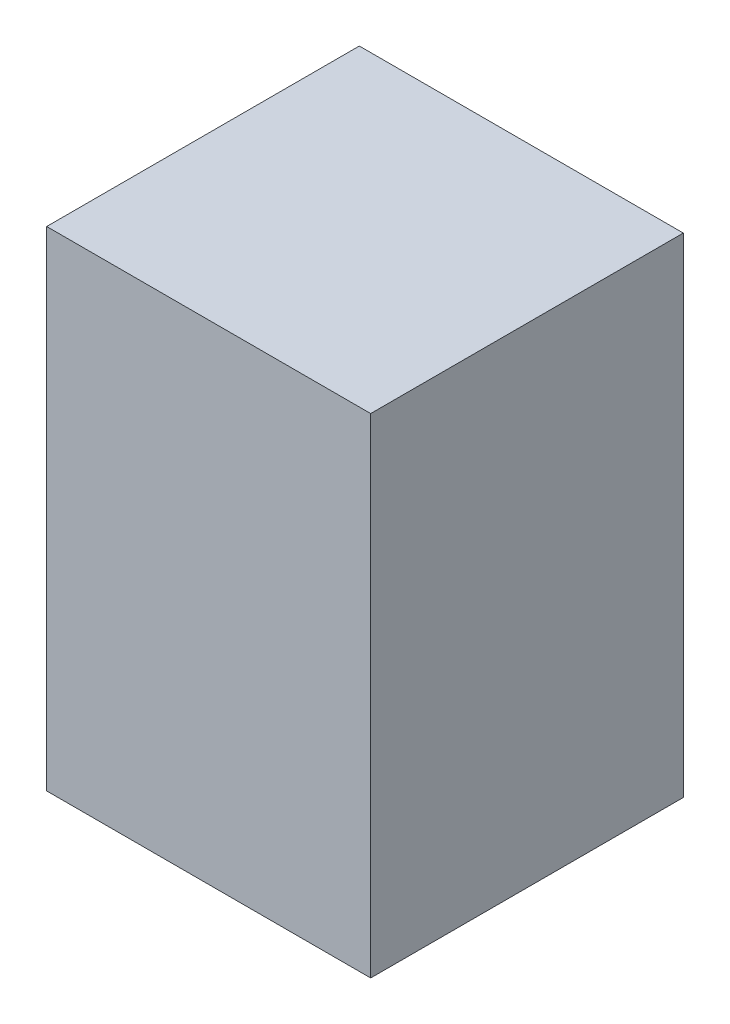
ISO-10303-21;
HEADER;
FILE_DESCRIPTION(('STEP AP214'),'2;1');
FILE_NAME('part.step','',(''),(''),'','','');
FILE_SCHEMA(('AUTOMOTIVE_DESIGN { 1 0 10303 214 1 1 1 1 }'));
ENDSEC;
DATA;
#1=APPLICATION_CONTEXT('core data for automotive mechanical design processes');
#2=APPLICATION_PROTOCOL_DEFINITION('international standard','automotive_design',2000,#1);
#3=PRODUCT_CONTEXT('',#1,'mechanical');
#4=PRODUCT('Part','Part','',(#3));
#5=PRODUCT_RELATED_PRODUCT_CATEGORY('part','',(#4));
#6=PRODUCT_DEFINITION_FORMATION('','',#4);
#7=PRODUCT_DEFINITION_CONTEXT('part definition',#1,'design');
#8=PRODUCT_DEFINITION('design','',#6,#7);
#9=PRODUCT_DEFINITION_SHAPE('','',#8);
#10=(LENGTH_UNIT() NAMED_UNIT(*) SI_UNIT(.MILLI.,.METRE.));
#11=(NAMED_UNIT(*) PLANE_ANGLE_UNIT() SI_UNIT($,.RADIAN.));
#12=(NAMED_UNIT(*) SI_UNIT($,.STERADIAN.) SOLID_ANGLE_UNIT());
#13=UNCERTAINTY_MEASURE_WITH_UNIT(LENGTH_MEASURE(1.E-05),#10,'distance_accuracy_value','');
#14=(GEOMETRIC_REPRESENTATION_CONTEXT(3) GLOBAL_UNCERTAINTY_ASSIGNED_CONTEXT((#13)) GLOBAL_UNIT_ASSIGNED_CONTEXT((#10,
#11,#12)) REPRESENTATION_CONTEXT('',''));
#15=CARTESIAN_POINT('',(0.,0.,0.));
#16=DIRECTION('',(0.,0.,1.));
#17=DIRECTION('',(1.,0.,0.));
#18=AXIS2_PLACEMENT_3D('',#15,#16,#17);
#19=CARTESIAN_POINT('',(57.,0.,55.));
#20=DIRECTION('',(0.,1.,0.));
#21=DIRECTION('',(0.,0.,1.));
#22=AXIS2_PLACEMENT_3D('',#19,#20,#21);
#23=PLANE('',#22);
#24=DIRECTION('',(1.,0.,0.));
#25=VECTOR('',#24,1.);
#26=CARTESIAN_POINT('',(57.,0.,0.));
#27=LINE('',#26,#25);
#28=CARTESIAN_POINT('',(0.,0.,0.));
#29=VERTEX_POINT('',#28);
#30=CARTESIAN_POINT('',(57.,0.,0.));
#31=VERTEX_POINT('',#30);
#32=EDGE_CURVE('E95',#29,#31,#27,.T.);
#33=ORIENTED_EDGE('',*,*,#32,.T.);
#34=DIRECTION('',(0.,0.,-1.));
#35=VECTOR('',#34,1.);
#36=CARTESIAN_POINT('',(57.,0.,55.));
#37=LINE('',#36,#35);
#38=CARTESIAN_POINT('',(57.,0.,55.));
#39=VERTEX_POINT('',#38);
#40=EDGE_CURVE('E11',#39,#31,#37,.T.);
#41=ORIENTED_EDGE('',*,*,#40,.F.);
#42=DIRECTION('',(1.,0.,0.));
#43=VECTOR('',#42,1.);
#44=CARTESIAN_POINT('',(57.,0.,55.));
#45=LINE('',#44,#43);
#46=CARTESIAN_POINT('',(0.,0.,55.));
#47=VERTEX_POINT('',#46);
#48=EDGE_CURVE('E83',#47,#39,#45,.T.);
#49=ORIENTED_EDGE('',*,*,#48,.F.);
#50=DIRECTION('',(0.,0.,-1.));
#51=VECTOR('',#50,1.);
#52=CARTESIAN_POINT('',(0.,0.,55.));
#53=LINE('',#52,#51);
#54=EDGE_CURVE('E91',#47,#29,#53,.T.);
#55=ORIENTED_EDGE('',*,*,#54,.T.);
#56=EDGE_LOOP('',(#33,#41,#49,#55));
#57=FACE_BOUND('',#56,.T.);
#58=ADVANCED_FACE('F32',(#57),#23,.F.);
#59=CARTESIAN_POINT('',(57.,86.,55.));
#60=DIRECTION('',(-1.,0.,0.));
#61=DIRECTION('',(0.,0.,1.));
#62=AXIS2_PLACEMENT_3D('',#59,#60,#61);
#63=PLANE('',#62);
#64=DIRECTION('',(0.,1.,0.));
#65=VECTOR('',#64,1.);
#66=CARTESIAN_POINT('',(57.,86.,0.));
#67=LINE('',#66,#65);
#68=CARTESIAN_POINT('',(57.,86.,0.));
#69=VERTEX_POINT('',#68);
#70=EDGE_CURVE('E87',#31,#69,#67,.T.);
#71=ORIENTED_EDGE('',*,*,#70,.T.);
#72=DIRECTION('',(0.,0.,-1.));
#73=VECTOR('',#72,1.);
#74=CARTESIAN_POINT('',(57.,86.,55.));
#75=LINE('',#74,#73);
#76=CARTESIAN_POINT('',(57.,86.,55.));
#77=VERTEX_POINT('',#76);
#78=EDGE_CURVE('E40',#77,#69,#75,.T.);
#79=ORIENTED_EDGE('',*,*,#78,.F.);
#80=DIRECTION('',(0.,1.,0.));
#81=VECTOR('',#80,1.);
#82=CARTESIAN_POINT('',(57.,86.,55.));
#83=LINE('',#82,#81);
#84=EDGE_CURVE('E78',#39,#77,#83,.T.);
#85=ORIENTED_EDGE('',*,*,#84,.F.);
#86=ORIENTED_EDGE('',*,*,#40,.T.);
#87=EDGE_LOOP('',(#71,#79,#85,#86));
#88=FACE_BOUND('',#87,.T.);
#89=ADVANCED_FACE('F86',(#88),#63,.F.);
#90=CARTESIAN_POINT('',(0.,86.,55.));
#91=DIRECTION('',(0.,-1.,0.));
#92=DIRECTION('',(0.,0.,-1.));
#93=AXIS2_PLACEMENT_3D('',#90,#91,#92);
#94=PLANE('',#93);
#95=DIRECTION('',(-1.,0.,0.));
#96=VECTOR('',#95,1.);
#97=CARTESIAN_POINT('',(0.,86.,0.));
#98=LINE('',#97,#96);
#99=CARTESIAN_POINT('',(0.,86.,0.));
#100=VERTEX_POINT('',#99);
#101=EDGE_CURVE('E65',#69,#100,#98,.T.);
#102=ORIENTED_EDGE('',*,*,#101,.T.);
#103=DIRECTION('',(0.,0.,-1.));
#104=VECTOR('',#103,1.);
#105=CARTESIAN_POINT('',(0.,86.,55.));
#106=LINE('',#105,#104);
#107=CARTESIAN_POINT('',(0.,86.,55.));
#108=VERTEX_POINT('',#107);
#109=EDGE_CURVE('E88',#108,#100,#106,.T.);
#110=ORIENTED_EDGE('',*,*,#109,.F.);
#111=DIRECTION('',(-1.,0.,0.));
#112=VECTOR('',#111,1.);
#113=CARTESIAN_POINT('',(0.,86.,55.));
#114=LINE('',#113,#112);
#115=EDGE_CURVE('E81',#77,#108,#114,.T.);
#116=ORIENTED_EDGE('',*,*,#115,.F.);
#117=ORIENTED_EDGE('',*,*,#78,.T.);
#118=EDGE_LOOP('',(#102,#110,#116,#117));
#119=FACE_BOUND('',#118,.T.);
#120=ADVANCED_FACE('F89',(#119),#94,.F.);
#121=CARTESIAN_POINT('',(0.,0.,55.));
#122=DIRECTION('',(1.,0.,0.));
#123=DIRECTION('',(0.,0.,-1.));
#124=AXIS2_PLACEMENT_3D('',#121,#122,#123);
#125=PLANE('',#124);
#126=DIRECTION('',(0.,-1.,0.));
#127=VECTOR('',#126,1.);
#128=CARTESIAN_POINT('',(0.,0.,0.));
#129=LINE('',#128,#127);
#130=EDGE_CURVE('E71',#100,#29,#129,.T.);
#131=ORIENTED_EDGE('',*,*,#130,.T.);
#132=ORIENTED_EDGE('',*,*,#54,.F.);
#133=DIRECTION('',(0.,-1.,0.));
#134=VECTOR('',#133,1.);
#135=CARTESIAN_POINT('',(0.,0.,55.));
#136=LINE('',#135,#134);
#137=EDGE_CURVE('E48',#108,#47,#136,.T.);
#138=ORIENTED_EDGE('',*,*,#137,.F.);
#139=ORIENTED_EDGE('',*,*,#109,.T.);
#140=EDGE_LOOP('',(#131,#132,#138,#139));
#141=FACE_BOUND('',#140,.T.);
#142=ADVANCED_FACE('F103',(#141),#125,.F.);
#143=CARTESIAN_POINT('',(0.,0.,55.));
#144=DIRECTION('',(0.,0.,-1.));
#145=DIRECTION('',(-1.,0.,0.));
#146=AXIS2_PLACEMENT_3D('',#143,#144,#145);
#147=PLANE('',#146);
#148=ORIENTED_EDGE('',*,*,#48,.T.);
#149=ORIENTED_EDGE('',*,*,#84,.T.);
#150=ORIENTED_EDGE('',*,*,#115,.T.);
#151=ORIENTED_EDGE('',*,*,#137,.T.);
#152=EDGE_LOOP('',(#148,#149,#150,#151));
#153=FACE_BOUND('',#152,.T.);
#154=ADVANCED_FACE('F79',(#153),#147,.F.);
#155=CARTESIAN_POINT('',(0.,0.,0.));
#156=DIRECTION('',(0.,0.,-1.));
#157=DIRECTION('',(-1.,0.,0.));
#158=AXIS2_PLACEMENT_3D('',#155,#156,#157);
#159=PLANE('',#158);
#160=CARTESIAN_POINT('',(53.,1.5,0.));
#161=DIRECTION('',(0.,0.,-1.));
#162=DIRECTION('',(-1.,0.,0.));
#163=AXIS2_PLACEMENT_3D('',#160,#161,#162);
#164=CIRCLE('',#163,0.499999999999999);
#165=CARTESIAN_POINT('',(52.5,1.5,0.));
#166=VERTEX_POINT('',#165);
#167=EDGE_CURVE('E122',#166,#166,#164,.T.);
#168=ORIENTED_EDGE('',*,*,#167,.F.);
#169=EDGE_LOOP('',(#168));
#170=FACE_BOUND('',#169,.T.);
#171=CARTESIAN_POINT('',(4.,84.5,0.));
#172=DIRECTION('',(0.,0.,-1.));
#173=DIRECTION('',(-1.,0.,0.));
#174=AXIS2_PLACEMENT_3D('',#171,#172,#173);
#175=CIRCLE('',#174,0.5);
#176=CARTESIAN_POINT('',(3.5,84.5,0.));
#177=VERTEX_POINT('',#176);
#178=EDGE_CURVE('E115',#177,#177,#175,.T.);
#179=ORIENTED_EDGE('',*,*,#178,.F.);
#180=EDGE_LOOP('',(#179));
#181=FACE_BOUND('',#180,.T.);
#182=CARTESIAN_POINT('',(53.,84.5,0.));
#183=DIRECTION('',(0.,0.,-1.));
#184=DIRECTION('',(-1.,0.,0.));
#185=AXIS2_PLACEMENT_3D('',#182,#183,#184);
#186=CIRCLE('',#185,0.499999999999999);
#187=CARTESIAN_POINT('',(52.5,84.5,0.));
#188=VERTEX_POINT('',#187);
#189=EDGE_CURVE('E127',#188,#188,#186,.T.);
#190=ORIENTED_EDGE('',*,*,#189,.F.);
#191=EDGE_LOOP('',(#190));
#192=FACE_BOUND('',#191,.T.);
#193=CARTESIAN_POINT('',(4.,1.5,0.));
#194=DIRECTION('',(0.,0.,-1.));
#195=DIRECTION('',(-1.,0.,0.));
#196=AXIS2_PLACEMENT_3D('',#193,#194,#195);
#197=CIRCLE('',#196,0.5);
#198=CARTESIAN_POINT('',(3.5,1.5,0.));
#199=VERTEX_POINT('',#198);
#200=EDGE_CURVE('E109',#199,#199,#197,.T.);
#201=ORIENTED_EDGE('',*,*,#200,.F.);
#202=EDGE_LOOP('',(#201));
#203=FACE_BOUND('',#202,.T.);
#204=ORIENTED_EDGE('',*,*,#32,.F.);
#205=ORIENTED_EDGE('',*,*,#130,.F.);
#206=ORIENTED_EDGE('',*,*,#101,.F.);
#207=ORIENTED_EDGE('',*,*,#70,.F.);
#208=EDGE_LOOP('',(#204,#205,#206,#207));
#209=FACE_BOUND('',#208,.T.);
#210=ADVANCED_FACE('F106',(#170,#181,#192,#203,#209),#159,.T.);
#211=CARTESIAN_POINT('',(4.,1.5,5.));
#212=DIRECTION('',(0.,0.,-1.));
#213=DIRECTION('',(-1.,0.,0.));
#214=AXIS2_PLACEMENT_3D('',#211,#212,#213);
#215=CYLINDRICAL_SURFACE('',#214,0.5);
#216=CARTESIAN_POINT('',(4.,1.5,5.));
#217=DIRECTION('',(0.,0.,-1.));
#218=DIRECTION('',(-1.,0.,0.));
#219=AXIS2_PLACEMENT_3D('',#216,#217,#218);
#220=CIRCLE('',#219,0.5);
#221=CARTESIAN_POINT('',(3.5,1.5,5.));
#222=VERTEX_POINT('',#221);
#223=EDGE_CURVE('E98',#222,#222,#220,.T.);
#224=ORIENTED_EDGE('',*,*,#223,.F.);
#225=EDGE_LOOP('',(#224));
#226=FACE_BOUND('',#225,.T.);
#227=ORIENTED_EDGE('',*,*,#200,.T.);
#228=EDGE_LOOP('',(#227));
#229=FACE_BOUND('',#228,.T.);
#230=ADVANCED_FACE('F144',(#226,#229),#215,.F.);
#231=CARTESIAN_POINT('',(4.,1.5,5.));
#232=DIRECTION('',(0.,0.,-1.));
#233=DIRECTION('',(-1.,0.,0.));
#234=AXIS2_PLACEMENT_3D('',#231,#232,#233);
#235=PLANE('',#234);
#236=ORIENTED_EDGE('',*,*,#223,.T.);
#237=EDGE_LOOP('',(#236));
#238=FACE_BOUND('',#237,.T.);
#239=ADVANCED_FACE('F138',(#238),#235,.T.);
#240=CARTESIAN_POINT('',(53.,84.5,5.));
#241=DIRECTION('',(0.,0.,-1.));
#242=DIRECTION('',(-1.,0.,0.));
#243=AXIS2_PLACEMENT_3D('',#240,#241,#242);
#244=CYLINDRICAL_SURFACE('',#243,0.499999999999999);
#245=CARTESIAN_POINT('',(53.,84.5,5.));
#246=DIRECTION('',(0.,0.,-1.));
#247=DIRECTION('',(-1.,0.,0.));
#248=AXIS2_PLACEMENT_3D('',#245,#246,#247);
#249=CIRCLE('',#248,0.499999999999999);
#250=CARTESIAN_POINT('',(52.5,84.5,5.));
#251=VERTEX_POINT('',#250);
#252=EDGE_CURVE('E119',#251,#251,#249,.T.);
#253=ORIENTED_EDGE('',*,*,#252,.F.);
#254=EDGE_LOOP('',(#253));
#255=FACE_BOUND('',#254,.T.);
#256=ORIENTED_EDGE('',*,*,#189,.T.);
#257=EDGE_LOOP('',(#256));
#258=FACE_BOUND('',#257,.T.);
#259=ADVANCED_FACE('F135',(#255,#258),#244,.F.);
#260=CARTESIAN_POINT('',(53.,84.5,5.));
#261=DIRECTION('',(0.,0.,-1.));
#262=DIRECTION('',(-1.,0.,0.));
#263=AXIS2_PLACEMENT_3D('',#260,#261,#262);
#264=PLANE('',#263);
#265=ORIENTED_EDGE('',*,*,#252,.T.);
#266=EDGE_LOOP('',(#265));
#267=FACE_BOUND('',#266,.T.);
#268=ADVANCED_FACE('F133',(#267),#264,.T.);
#269=CARTESIAN_POINT('',(4.,84.5,5.));
#270=DIRECTION('',(0.,0.,-1.));
#271=DIRECTION('',(-1.,0.,0.));
#272=AXIS2_PLACEMENT_3D('',#269,#270,#271);
#273=CYLINDRICAL_SURFACE('',#272,0.5);
#274=CARTESIAN_POINT('',(4.,84.5,5.));
#275=DIRECTION('',(0.,0.,-1.));
#276=DIRECTION('',(-1.,0.,0.));
#277=AXIS2_PLACEMENT_3D('',#274,#275,#276);
#278=CIRCLE('',#277,0.5);
#279=CARTESIAN_POINT('',(3.5,84.5,5.));
#280=VERTEX_POINT('',#279);
#281=EDGE_CURVE('E118',#280,#280,#278,.T.);
#282=ORIENTED_EDGE('',*,*,#281,.F.);
#283=EDGE_LOOP('',(#282));
#284=FACE_BOUND('',#283,.T.);
#285=ORIENTED_EDGE('',*,*,#178,.T.);
#286=EDGE_LOOP('',(#285));
#287=FACE_BOUND('',#286,.T.);
#288=ADVANCED_FACE('F203',(#284,#287),#273,.F.);
#289=CARTESIAN_POINT('',(4.,84.5,5.));
#290=DIRECTION('',(0.,0.,-1.));
#291=DIRECTION('',(-1.,0.,0.));
#292=AXIS2_PLACEMENT_3D('',#289,#290,#291);
#293=PLANE('',#292);
#294=ORIENTED_EDGE('',*,*,#281,.T.);
#295=EDGE_LOOP('',(#294));
#296=FACE_BOUND('',#295,.T.);
#297=ADVANCED_FACE('F212',(#296),#293,.T.);
#298=CARTESIAN_POINT('',(53.,1.5,5.));
#299=DIRECTION('',(0.,0.,-1.));
#300=DIRECTION('',(-1.,0.,0.));
#301=AXIS2_PLACEMENT_3D('',#298,#299,#300);
#302=CYLINDRICAL_SURFACE('',#301,0.499999999999999);
#303=CARTESIAN_POINT('',(53.,1.5,5.));
#304=DIRECTION('',(0.,0.,-1.));
#305=DIRECTION('',(-1.,0.,0.));
#306=AXIS2_PLACEMENT_3D('',#303,#304,#305);
#307=CIRCLE('',#306,0.499999999999999);
#308=CARTESIAN_POINT('',(52.5,1.5,5.));
#309=VERTEX_POINT('',#308);
#310=EDGE_CURVE('E112',#309,#309,#307,.T.);
#311=ORIENTED_EDGE('',*,*,#310,.F.);
#312=EDGE_LOOP('',(#311));
#313=FACE_BOUND('',#312,.T.);
#314=ORIENTED_EDGE('',*,*,#167,.T.);
#315=EDGE_LOOP('',(#314));
#316=FACE_BOUND('',#315,.T.);
#317=ADVANCED_FACE('F222',(#313,#316),#302,.F.);
#318=CARTESIAN_POINT('',(53.,1.5,5.));
#319=DIRECTION('',(0.,0.,-1.));
#320=DIRECTION('',(-1.,0.,0.));
#321=AXIS2_PLACEMENT_3D('',#318,#319,#320);
#322=PLANE('',#321);
#323=ORIENTED_EDGE('',*,*,#310,.T.);
#324=EDGE_LOOP('',(#323));
#325=FACE_BOUND('',#324,.T.);
#326=ADVANCED_FACE('F232',(#325),#322,.T.);
#327=CLOSED_SHELL('',(#58,#89,#120,#142,#154,#210,#230,#239,#259,#268,#288,#297,#317,#326));
#328=MANIFOLD_SOLID_BREP('B2',#327);
#329=ADVANCED_BREP_SHAPE_REPRESENTATION('',(#18,#328),#14);
#330=SHAPE_DEFINITION_REPRESENTATION(#9,#329);
ENDSEC;
END-ISO-10303-21;
